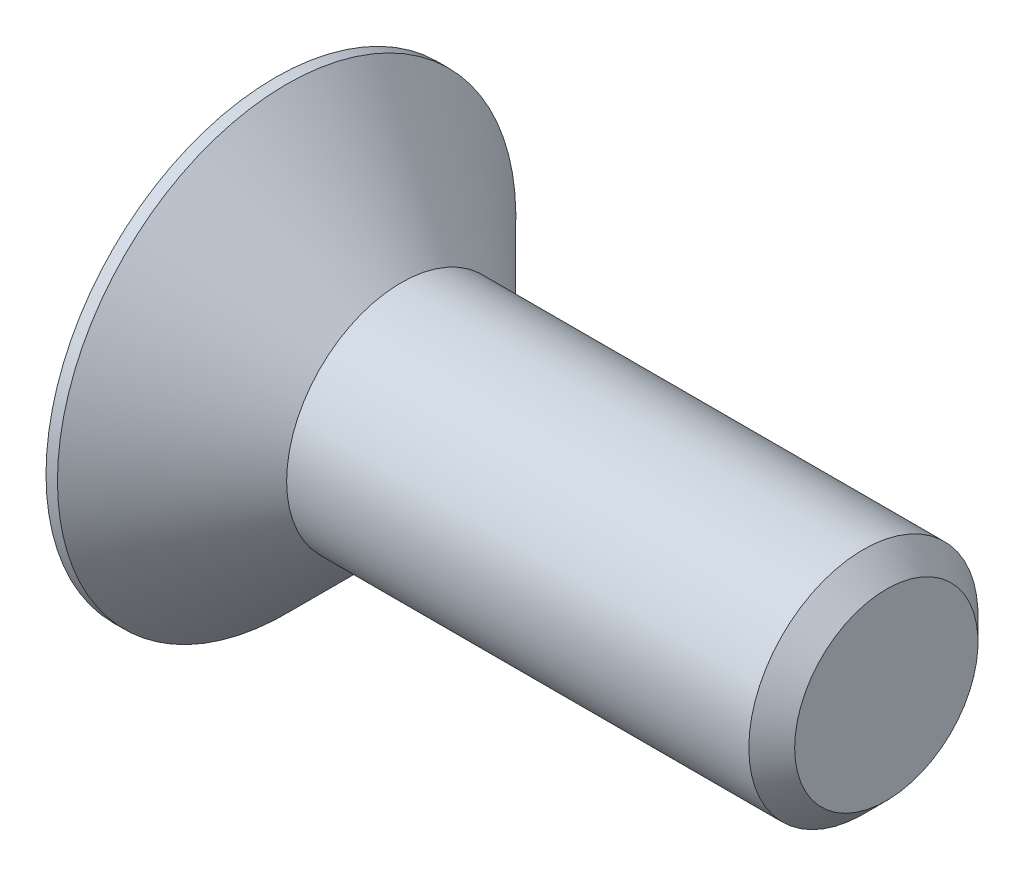
ISO-10303-21;
HEADER;
FILE_DESCRIPTION(('STEP AP214'),'2;1');
FILE_NAME('part.step','',(''),(''),'','','');
FILE_SCHEMA(('AUTOMOTIVE_DESIGN { 1 0 10303 214 1 1 1 1 }'));
ENDSEC;
DATA;
#1=APPLICATION_CONTEXT('core data for automotive mechanical design processes');
#2=APPLICATION_PROTOCOL_DEFINITION('international standard','automotive_design',2000,#1);
#3=PRODUCT_CONTEXT('',#1,'mechanical');
#4=PRODUCT('Part','Part','',(#3));
#5=PRODUCT_RELATED_PRODUCT_CATEGORY('part','',(#4));
#6=PRODUCT_DEFINITION_FORMATION('','',#4);
#7=PRODUCT_DEFINITION_CONTEXT('part definition',#1,'design');
#8=PRODUCT_DEFINITION('design','',#6,#7);
#9=PRODUCT_DEFINITION_SHAPE('','',#8);
#10=(LENGTH_UNIT() NAMED_UNIT(*) SI_UNIT(.MILLI.,.METRE.));
#11=(NAMED_UNIT(*) PLANE_ANGLE_UNIT() SI_UNIT($,.RADIAN.));
#12=(NAMED_UNIT(*) SI_UNIT($,.STERADIAN.) SOLID_ANGLE_UNIT());
#13=UNCERTAINTY_MEASURE_WITH_UNIT(LENGTH_MEASURE(1.E-05),#10,'distance_accuracy_value','');
#14=(GEOMETRIC_REPRESENTATION_CONTEXT(3) GLOBAL_UNCERTAINTY_ASSIGNED_CONTEXT((#13)) GLOBAL_UNIT_ASSIGNED_CONTEXT((#10,
#11,#12)) REPRESENTATION_CONTEXT('',''));
#15=CARTESIAN_POINT('',(0.,0.,0.));
#16=DIRECTION('',(0.,0.,1.));
#17=DIRECTION('',(1.,0.,0.));
#18=AXIS2_PLACEMENT_3D('',#15,#16,#17);
#19=CARTESIAN_POINT('',(1.65,-4.92130635213824E-09,-37.5000000629962));
#20=DIRECTION('',(-1.,0.,0.));
#21=DIRECTION('',(0.,0.,1.));
#22=AXIS2_PLACEMENT_3D('',#19,#20,#21);
#23=PLANE('',#22);
#24=DIRECTION('',(0.,1.,0.));
#25=VECTOR('',#24,1.);
#26=CARTESIAN_POINT('',(1.64999999999991,-4.92127583129331E-09,-35.5000000629962));
#27=LINE('',#26,#25);
#28=CARTESIAN_POINT('',(1.64999999999992,-1.15470054330054,-35.5000000629962));
#29=VERTEX_POINT('',#28);
#30=CARTESIAN_POINT('',(1.64999999999995,1.15470053345796,-35.5000000629963));
#31=VERTEX_POINT('',#30);
#32=EDGE_CURVE('E83',#29,#31,#27,.T.);
#33=ORIENTED_EDGE('',*,*,#32,.T.);
#34=DIRECTION('',(0.,-0.5,0.866025403784439));
#35=VECTOR('',#34,1.);
#36=CARTESIAN_POINT('',(1.64999999999996,1.7320508026476,-36.5000000629963));
#37=LINE('',#36,#35);
#38=CARTESIAN_POINT('',(1.65000000000002,2.30940107183718,-37.5000000629962));
#39=VERTEX_POINT('',#38);
#40=EDGE_CURVE('E67',#31,#39,#37,.F.);
#41=ORIENTED_EDGE('',*,*,#40,.T.);
#42=DIRECTION('',(0.,0.5,0.866025403784439));
#43=VECTOR('',#42,1.);
#44=CARTESIAN_POINT('',(1.65000000000004,1.73205080264755,-38.5000000629963));
#45=LINE('',#44,#43);
#46=CARTESIAN_POINT('',(1.65000000000006,1.15470053345796,-39.5000000629962));
#47=VERTEX_POINT('',#46);
#48=EDGE_CURVE('E72',#39,#47,#45,.F.);
#49=ORIENTED_EDGE('',*,*,#48,.T.);
#50=DIRECTION('',(0.,1.,0.));
#51=VECTOR('',#50,1.);
#52=CARTESIAN_POINT('',(1.65000000000009,-4.92127583129331E-09,-39.5000000629962));
#53=LINE('',#52,#51);
#54=CARTESIAN_POINT('',(1.65000000000005,-1.15470054330054,-39.5000000629963));
#55=VERTEX_POINT('',#54);
#56=EDGE_CURVE('E110',#47,#55,#53,.F.);
#57=ORIENTED_EDGE('',*,*,#56,.T.);
#58=DIRECTION('',(0.,0.5,-0.866025403784439));
#59=VECTOR('',#58,1.);
#60=CARTESIAN_POINT('',(1.65000000000004,-1.73205081249015,-38.5000000629963));
#61=LINE('',#60,#59);
#62=CARTESIAN_POINT('',(1.64999999999998,-2.30940108167982,-37.5000000629962));
#63=VERTEX_POINT('',#62);
#64=EDGE_CURVE('E114',#55,#63,#61,.F.);
#65=ORIENTED_EDGE('',*,*,#64,.T.);
#66=DIRECTION('',(0.,-0.5,-0.866025403784439));
#67=VECTOR('',#66,1.);
#68=CARTESIAN_POINT('',(1.64999999999996,-1.7320508124902,-36.5000000629963));
#69=LINE('',#68,#67);
#70=EDGE_CURVE('E119',#63,#29,#69,.F.);
#71=ORIENTED_EDGE('',*,*,#70,.T.);
#72=EDGE_LOOP('',(#33,#41,#49,#57,#65,#71));
#73=FACE_BOUND('',#72,.T.);
#74=ADVANCED_FACE('F17',(#73),#23,.T.);
#75=CARTESIAN_POINT('',(0.,1.7320508026476,-38.5000000629963));
#76=DIRECTION('',(0.,0.866025403784439,-0.5));
#77=DIRECTION('',(0.,0.5,0.866025403784439));
#78=AXIS2_PLACEMENT_3D('',#75,#76,#77);
#79=PLANE('',#78);
#80=DIRECTION('',(1.,0.,0.));
#81=VECTOR('',#80,1.);
#82=CARTESIAN_POINT('',(0.,2.30940107183718,-37.5000000629962));
#83=LINE('',#82,#81);
#84=CARTESIAN_POINT('',(0.,2.30940107183722,-37.5000000629963));
#85=VERTEX_POINT('',#84);
#86=EDGE_CURVE('E74',#39,#85,#83,.F.);
#87=ORIENTED_EDGE('',*,*,#86,.T.);
#88=DIRECTION('',(0.,0.499999999999999,0.866025403784439));
#89=VECTOR('',#88,1.);
#90=CARTESIAN_POINT('',(0.,1.15470053345798,-39.5000000629963));
#91=LINE('',#90,#89);
#92=CARTESIAN_POINT('',(0.,1.154700533458,-39.5000000629963));
#93=VERTEX_POINT('',#92);
#94=EDGE_CURVE('E108',#93,#85,#91,.T.);
#95=ORIENTED_EDGE('',*,*,#94,.F.);
#96=DIRECTION('',(-1.,0.,0.));
#97=VECTOR('',#96,1.);
#98=CARTESIAN_POINT('',(0.,1.15470053345798,-39.5000000629963));
#99=LINE('',#98,#97);
#100=EDGE_CURVE('E77',#93,#47,#99,.F.);
#101=ORIENTED_EDGE('',*,*,#100,.T.);
#102=ORIENTED_EDGE('',*,*,#48,.F.);
#103=EDGE_LOOP('',(#87,#95,#101,#102));
#104=FACE_BOUND('',#103,.T.);
#105=ADVANCED_FACE('F73',(#104),#79,.F.);
#106=CARTESIAN_POINT('',(0.,1.7320508026476,-36.5000000629963));
#107=DIRECTION('',(0.,0.866025403784439,0.5));
#108=DIRECTION('',(0.,-0.5,0.866025403784439));
#109=AXIS2_PLACEMENT_3D('',#106,#107,#108);
#110=PLANE('',#109);
#111=DIRECTION('',(1.,0.,0.));
#112=VECTOR('',#111,1.);
#113=CARTESIAN_POINT('',(0.,1.15470053345794,-35.5000000629963));
#114=LINE('',#113,#112);
#115=CARTESIAN_POINT('',(0.,1.15470053345797,-35.5000000629963));
#116=VERTEX_POINT('',#115);
#117=EDGE_CURVE('E85',#31,#116,#114,.F.);
#118=ORIENTED_EDGE('',*,*,#117,.T.);
#119=DIRECTION('',(0.,-0.499999999999999,0.866025403784439));
#120=VECTOR('',#119,1.);
#121=CARTESIAN_POINT('',(0.,2.30940107183723,-37.5000000629963));
#122=LINE('',#121,#120);
#123=EDGE_CURVE('E89',#85,#116,#122,.T.);
#124=ORIENTED_EDGE('',*,*,#123,.F.);
#125=ORIENTED_EDGE('',*,*,#86,.F.);
#126=ORIENTED_EDGE('',*,*,#40,.F.);
#127=EDGE_LOOP('',(#118,#124,#125,#126));
#128=FACE_BOUND('',#127,.T.);
#129=ADVANCED_FACE('F87',(#128),#110,.F.);
#130=CARTESIAN_POINT('',(0.,-4.92127583129331E-09,-35.5000000629963));
#131=DIRECTION('',(0.,0.,1.));
#132=DIRECTION('',(1.,0.,0.));
#133=AXIS2_PLACEMENT_3D('',#130,#131,#132);
#134=PLANE('',#133);
#135=DIRECTION('',(1.,0.,0.));
#136=VECTOR('',#135,1.);
#137=CARTESIAN_POINT('',(0.,-1.15470054330049,-35.5000000629962));
#138=LINE('',#137,#136);
#139=CARTESIAN_POINT('',(0.,-1.15470054330052,-35.5000000629963));
#140=VERTEX_POINT('',#139);
#141=EDGE_CURVE('E121',#29,#140,#138,.F.);
#142=ORIENTED_EDGE('',*,*,#141,.T.);
#143=DIRECTION('',(0.,1.,0.));
#144=VECTOR('',#143,1.);
#145=CARTESIAN_POINT('',(-1.1274083889188E-13,-2.59807621627459,-35.5000000629963));
#146=LINE('',#145,#144);
#147=EDGE_CURVE('E126',#116,#140,#146,.F.);
#148=ORIENTED_EDGE('',*,*,#147,.F.);
#149=ORIENTED_EDGE('',*,*,#117,.F.);
#150=ORIENTED_EDGE('',*,*,#32,.F.);
#151=EDGE_LOOP('',(#142,#148,#149,#150));
#152=FACE_BOUND('',#151,.T.);
#153=ADVANCED_FACE('F127',(#152),#134,.F.);
#154=CARTESIAN_POINT('',(0.,-1.73205081249015,-36.5000000629963));
#155=DIRECTION('',(0.,-0.866025403784439,0.5));
#156=DIRECTION('',(0.,-0.5,-0.866025403784439));
#157=AXIS2_PLACEMENT_3D('',#154,#155,#156);
#158=PLANE('',#157);
#159=DIRECTION('',(1.,0.,0.));
#160=VECTOR('',#159,1.);
#161=CARTESIAN_POINT('',(0.,-2.30940108167983,-37.5000000629962));
#162=LINE('',#161,#160);
#163=CARTESIAN_POINT('',(0.,-2.30940108167979,-37.5000000629963));
#164=VERTEX_POINT('',#163);
#165=EDGE_CURVE('E117',#63,#164,#162,.F.);
#166=ORIENTED_EDGE('',*,*,#165,.T.);
#167=DIRECTION('',(0.,-0.499999999999999,-0.866025403784439));
#168=VECTOR('',#167,1.);
#169=CARTESIAN_POINT('',(0.,-1.15470054330053,-35.5000000629963));
#170=LINE('',#169,#168);
#171=EDGE_CURVE('E132',#140,#164,#170,.T.);
#172=ORIENTED_EDGE('',*,*,#171,.F.);
#173=ORIENTED_EDGE('',*,*,#141,.F.);
#174=ORIENTED_EDGE('',*,*,#70,.F.);
#175=EDGE_LOOP('',(#166,#172,#173,#174));
#176=FACE_BOUND('',#175,.T.);
#177=ADVANCED_FACE('F146',(#176),#158,.F.);
#178=CARTESIAN_POINT('',(0.,-1.73205081249015,-38.5000000629963));
#179=DIRECTION('',(0.,-0.866025403784439,-0.5));
#180=DIRECTION('',(0.,0.5,-0.866025403784439));
#181=AXIS2_PLACEMENT_3D('',#178,#179,#180);
#182=PLANE('',#181);
#183=DIRECTION('',(-1.,0.,0.));
#184=VECTOR('',#183,1.);
#185=CARTESIAN_POINT('',(0.,-1.15470054330056,-39.5000000629963));
#186=LINE('',#185,#184);
#187=CARTESIAN_POINT('',(0.,-1.15470054330053,-39.5000000629963));
#188=VERTEX_POINT('',#187);
#189=EDGE_CURVE('E35',#55,#188,#186,.T.);
#190=ORIENTED_EDGE('',*,*,#189,.T.);
#191=DIRECTION('',(0.,0.499999999999999,-0.866025403784439));
#192=VECTOR('',#191,1.);
#193=CARTESIAN_POINT('',(0.,-2.30940108167978,-37.5000000629963));
#194=LINE('',#193,#192);
#195=EDGE_CURVE('E139',#164,#188,#194,.T.);
#196=ORIENTED_EDGE('',*,*,#195,.F.);
#197=ORIENTED_EDGE('',*,*,#165,.F.);
#198=ORIENTED_EDGE('',*,*,#64,.F.);
#199=EDGE_LOOP('',(#190,#196,#197,#198));
#200=FACE_BOUND('',#199,.T.);
#201=ADVANCED_FACE('F144',(#200),#182,.F.);
#202=CARTESIAN_POINT('',(0.,-4.92127583129331E-09,-39.5000000629963));
#203=DIRECTION('',(0.,0.,-1.));
#204=DIRECTION('',(-1.,0.,0.));
#205=AXIS2_PLACEMENT_3D('',#202,#203,#204);
#206=PLANE('',#205);
#207=ORIENTED_EDGE('',*,*,#100,.F.);
#208=DIRECTION('',(0.,1.,0.));
#209=VECTOR('',#208,1.);
#210=CARTESIAN_POINT('',(0.,-2.59807621627459,-39.5000000629963));
#211=LINE('',#210,#209);
#212=EDGE_CURVE('E105',#188,#93,#211,.T.);
#213=ORIENTED_EDGE('',*,*,#212,.F.);
#214=ORIENTED_EDGE('',*,*,#189,.F.);
#215=ORIENTED_EDGE('',*,*,#56,.F.);
#216=EDGE_LOOP('',(#207,#213,#214,#215));
#217=FACE_BOUND('',#216,.T.);
#218=ADVANCED_FACE('F142',(#217),#206,.F.);
#219=CARTESIAN_POINT('',(0.,-2.59807621627459,-36.0000000629963));
#220=DIRECTION('',(-1.,0.,0.));
#221=DIRECTION('',(0.,0.,1.));
#222=AXIS2_PLACEMENT_3D('',#219,#220,#221);
#223=PLANE('',#222);
#224=CARTESIAN_POINT('',(0.,-4.92127583129332E-09,-37.5000000629963));
#225=DIRECTION('',(-1.,0.,0.));
#226=DIRECTION('',(0.,0.,1.));
#227=AXIS2_PLACEMENT_3D('',#224,#225,#226);
#228=CIRCLE('',#227,6.);
#229=CARTESIAN_POINT('',(-1.93528676934388E-13,-4.92127583129332E-09,-31.5000000629963));
#230=VERTEX_POINT('',#229);
#231=EDGE_CURVE('E20',#230,#230,#228,.F.);
#232=ORIENTED_EDGE('',*,*,#231,.F.);
#233=EDGE_LOOP('',(#232));
#234=FACE_BOUND('',#233,.T.);
#235=ORIENTED_EDGE('',*,*,#195,.T.);
#236=ORIENTED_EDGE('',*,*,#212,.T.);
#237=ORIENTED_EDGE('',*,*,#94,.T.);
#238=ORIENTED_EDGE('',*,*,#123,.T.);
#239=ORIENTED_EDGE('',*,*,#147,.T.);
#240=ORIENTED_EDGE('',*,*,#171,.T.);
#241=EDGE_LOOP('',(#235,#236,#237,#238,#239,#240));
#242=FACE_BOUND('',#241,.T.);
#243=ADVANCED_FACE('F135',(#234,#242),#223,.T.);
#244=CARTESIAN_POINT('',(0.150000000000001,-4.92127861463312E-09,-37.5000000629963));
#245=DIRECTION('',(-1.,0.,0.));
#246=DIRECTION('',(0.,0.,1.));
#247=AXIS2_PLACEMENT_3D('',#244,#245,#246);
#248=CYLINDRICAL_SURFACE('',#247,6.);
#249=ORIENTED_EDGE('',*,*,#231,.T.);
#250=EDGE_LOOP('',(#249));
#251=FACE_BOUND('',#250,.T.);
#252=CARTESIAN_POINT('',(0.300000000038574,-4.92128139797292E-09,-37.5000000629962));
#253=DIRECTION('',(-1.,0.,0.));
#254=DIRECTION('',(0.,-0.866025403786166,0.499999999997008));
#255=AXIS2_PLACEMENT_3D('',#252,#253,#254);
#256=CIRCLE('',#255,5.99999999998973);
#257=CARTESIAN_POINT('',(0.300000000038381,-5.19615242762939,-34.5000000630193));
#258=VERTEX_POINT('',#257);
#259=EDGE_CURVE('E95',#258,#258,#256,.F.);
#260=ORIENTED_EDGE('',*,*,#259,.F.);
#261=EDGE_LOOP('',(#260));
#262=FACE_BOUND('',#261,.T.);
#263=ADVANCED_FACE('F174',(#251,#262),#248,.T.);
#264=CARTESIAN_POINT('',(15.9999999999999,-1.29903811059823,-36.7500000629957));
#265=DIRECTION('',(1.,0.,0.));
#266=DIRECTION('',(0.,0.,-1.));
#267=AXIS2_PLACEMENT_3D('',#264,#265,#266);
#268=PLANE('',#267);
#269=CARTESIAN_POINT('',(16.0000000000194,-4.92157356445873E-09,-37.5000000629957));
#270=DIRECTION('',(-1.,0.,0.));
#271=DIRECTION('',(0.,0.,1.));
#272=AXIS2_PLACEMENT_3D('',#269,#270,#271);
#273=CIRCLE('',#272,2.39999999999631);
#274=CARTESIAN_POINT('',(16.0000000000193,-4.92157356445873E-09,-35.1000000629994));
#275=VERTEX_POINT('',#274);
#276=EDGE_CURVE('E93',#275,#275,#273,.T.);
#277=ORIENTED_EDGE('',*,*,#276,.F.);
#278=EDGE_LOOP('',(#277));
#279=FACE_BOUND('',#278,.T.);
#280=ADVANCED_FACE('F171',(#279),#268,.T.);
#281=CARTESIAN_POINT('',(0.300000000038574,-4.92128126444724E-09,-37.5000000629962));
#282=DIRECTION('',(-1.,0.,0.));
#283=DIRECTION('',(0.,0.,1.));
#284=AXIS2_PLACEMENT_3D('',#281,#282,#283);
#285=CONICAL_SURFACE('',#284,5.99999999998973,0.785398163394607);
#286=ORIENTED_EDGE('',*,*,#259,.T.);
#287=EDGE_LOOP('',(#286));
#288=FACE_BOUND('',#287,.T.);
#289=CARTESIAN_POINT('',(3.3,-4.92133706476896E-09,-37.5000000629962));
#290=DIRECTION('',(-1.,0.,0.));
#291=DIRECTION('',(0.,0.,1.));
#292=AXIS2_PLACEMENT_3D('',#289,#290,#291);
#293=CIRCLE('',#292,3.);
#294=CARTESIAN_POINT('',(3.2999999999999,-4.92133706476896E-09,-34.5000000629962));
#295=VERTEX_POINT('',#294);
#296=EDGE_CURVE('E26',#295,#295,#293,.F.);
#297=ORIENTED_EDGE('',*,*,#296,.F.);
#298=EDGE_LOOP('',(#297));
#299=FACE_BOUND('',#298,.T.);
#300=ADVANCED_FACE('F164',(#288,#299),#285,.T.);
#301=CARTESIAN_POINT('',(15.4000000000564,-4.92156228965035E-09,-37.5000000629957));
#302=DIRECTION('',(-1.,0.,0.));
#303=DIRECTION('',(0.,0.,1.));
#304=AXIS2_PLACEMENT_3D('',#301,#302,#303);
#305=CONICAL_SURFACE('',#304,2.99999999991778,0.785398163362821);
#306=CARTESIAN_POINT('',(15.4,-4.92156158751298E-09,-37.5000000629958));
#307=DIRECTION('',(-1.,0.,0.));
#308=DIRECTION('',(0.,0.,1.));
#309=AXIS2_PLACEMENT_3D('',#306,#307,#308);
#310=CIRCLE('',#309,3.);
#311=CARTESIAN_POINT('',(15.3999999999999,-4.92156158751298E-09,-34.5000000629958));
#312=VERTEX_POINT('',#311);
#313=EDGE_CURVE('E11',#312,#312,#310,.T.);
#314=ORIENTED_EDGE('',*,*,#313,.F.);
#315=EDGE_LOOP('',(#314));
#316=FACE_BOUND('',#315,.T.);
#317=ORIENTED_EDGE('',*,*,#276,.T.);
#318=EDGE_LOOP('',(#317));
#319=FACE_BOUND('',#318,.T.);
#320=ADVANCED_FACE('F158',(#316,#319),#305,.T.);
#321=CARTESIAN_POINT('',(9.65,-4.92145489282057E-09,-37.500000062996));
#322=DIRECTION('',(-1.,0.,0.));
#323=DIRECTION('',(0.,0.,1.));
#324=AXIS2_PLACEMENT_3D('',#321,#322,#323);
#325=CYLINDRICAL_SURFACE('',#324,3.);
#326=ORIENTED_EDGE('',*,*,#296,.T.);
#327=EDGE_LOOP('',(#326));
#328=FACE_BOUND('',#327,.T.);
#329=ORIENTED_EDGE('',*,*,#313,.T.);
#330=EDGE_LOOP('',(#329));
#331=FACE_BOUND('',#330,.T.);
#332=ADVANCED_FACE('F156',(#328,#331),#325,.T.);
#333=CLOSED_SHELL('',(#74,#105,#129,#153,#177,#201,#218,#243,#263,#280,#300,#320,#332));
#334=MANIFOLD_SOLID_BREP('B1',#333);
#335=ADVANCED_BREP_SHAPE_REPRESENTATION('',(#18,#334),#14);
#336=SHAPE_DEFINITION_REPRESENTATION(#9,#335);
ENDSEC;
END-ISO-10303-21;
